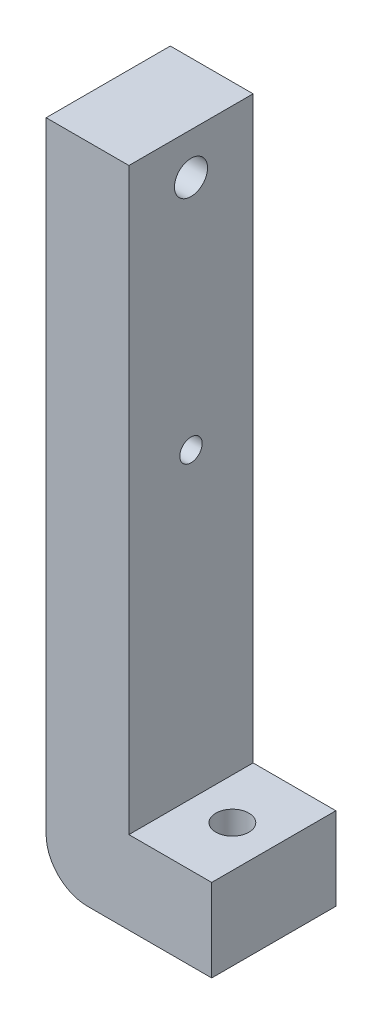
ISO-10303-21;
HEADER;
FILE_DESCRIPTION(('STEP AP214'),'2;1');
FILE_NAME('part.step','',(''),(''),'','','');
FILE_SCHEMA(('AUTOMOTIVE_DESIGN { 1 0 10303 214 1 1 1 1 }'));
ENDSEC;
DATA;
#1=APPLICATION_CONTEXT('core data for automotive mechanical design processes');
#2=APPLICATION_PROTOCOL_DEFINITION('international standard','automotive_design',2000,#1);
#3=PRODUCT_CONTEXT('',#1,'mechanical');
#4=PRODUCT('Part','Part','',(#3));
#5=PRODUCT_RELATED_PRODUCT_CATEGORY('part','',(#4));
#6=PRODUCT_DEFINITION_FORMATION('','',#4);
#7=PRODUCT_DEFINITION_CONTEXT('part definition',#1,'design');
#8=PRODUCT_DEFINITION('design','',#6,#7);
#9=PRODUCT_DEFINITION_SHAPE('','',#8);
#10=(LENGTH_UNIT() NAMED_UNIT(*) SI_UNIT(.MILLI.,.METRE.));
#11=(NAMED_UNIT(*) PLANE_ANGLE_UNIT() SI_UNIT($,.RADIAN.));
#12=(NAMED_UNIT(*) SI_UNIT($,.STERADIAN.) SOLID_ANGLE_UNIT());
#13=UNCERTAINTY_MEASURE_WITH_UNIT(LENGTH_MEASURE(1.E-05),#10,'distance_accuracy_value','');
#14=(GEOMETRIC_REPRESENTATION_CONTEXT(3) GLOBAL_UNCERTAINTY_ASSIGNED_CONTEXT((#13)) GLOBAL_UNIT_ASSIGNED_CONTEXT((#10,
#11,#12)) REPRESENTATION_CONTEXT('',''));
#15=CARTESIAN_POINT('',(0.,0.,0.));
#16=DIRECTION('',(0.,0.,1.));
#17=DIRECTION('',(1.,0.,0.));
#18=AXIS2_PLACEMENT_3D('',#15,#16,#17);
#19=CARTESIAN_POINT('',(-10.,-20.,15.));
#20=DIRECTION('',(1.,0.,0.));
#21=DIRECTION('',(0.,0.,-1.));
#22=AXIS2_PLACEMENT_3D('',#19,#20,#21);
#23=PLANE('',#22);
#24=CARTESIAN_POINT('',(-10.,26.5,7.5));
#25=DIRECTION('',(-1.,0.,0.));
#26=DIRECTION('',(0.,0.,1.));
#27=AXIS2_PLACEMENT_3D('',#24,#25,#26);
#28=CIRCLE('',#27,1.35);
#29=CARTESIAN_POINT('',(-10.,26.5,8.85));
#30=VERTEX_POINT('',#29);
#31=EDGE_CURVE('E176',#30,#30,#28,.T.);
#32=ORIENTED_EDGE('',*,*,#31,.F.);
#33=EDGE_LOOP('',(#32));
#34=FACE_BOUND('',#33,.T.);
#35=CARTESIAN_POINT('',(-10.,55.,7.5));
#36=DIRECTION('',(-1.,0.,0.));
#37=DIRECTION('',(0.,0.,1.));
#38=AXIS2_PLACEMENT_3D('',#35,#36,#37);
#39=CIRCLE('',#38,2.);
#40=CARTESIAN_POINT('',(-10.,55.,9.49999999999999));
#41=VERTEX_POINT('',#40);
#42=EDGE_CURVE('E168',#41,#41,#39,.T.);
#43=ORIENTED_EDGE('',*,*,#42,.F.);
#44=EDGE_LOOP('',(#43));
#45=FACE_BOUND('',#44,.T.);
#46=DIRECTION('',(0.,-1.,0.));
#47=VECTOR('',#46,1.);
#48=CARTESIAN_POINT('',(-10.,-20.,0.));
#49=LINE('',#48,#47);
#50=CARTESIAN_POINT('',(-10.,60.,0.));
#51=VERTEX_POINT('',#50);
#52=CARTESIAN_POINT('',(-10.,-15.,0.));
#53=VERTEX_POINT('',#52);
#54=EDGE_CURVE('E120',#51,#53,#49,.T.);
#55=ORIENTED_EDGE('',*,*,#54,.T.);
#56=DIRECTION('',(0.,0.,-1.));
#57=VECTOR('',#56,1.);
#58=CARTESIAN_POINT('',(-10.,-15.,15.));
#59=LINE('',#58,#57);
#60=CARTESIAN_POINT('',(-10.,-15.,15.));
#61=VERTEX_POINT('',#60);
#62=EDGE_CURVE('E54',#53,#61,#59,.F.);
#63=ORIENTED_EDGE('',*,*,#62,.T.);
#64=DIRECTION('',(0.,-1.,0.));
#65=VECTOR('',#64,1.);
#66=CARTESIAN_POINT('',(-10.,-20.,15.));
#67=LINE('',#66,#65);
#68=CARTESIAN_POINT('',(-10.,60.,15.));
#69=VERTEX_POINT('',#68);
#70=EDGE_CURVE('E114',#69,#61,#67,.T.);
#71=ORIENTED_EDGE('',*,*,#70,.F.);
#72=DIRECTION('',(0.,0.,1.));
#73=VECTOR('',#72,1.);
#74=CARTESIAN_POINT('',(-10.,60.,0.));
#75=LINE('',#74,#73);
#76=EDGE_CURVE('E124',#51,#69,#75,.T.);
#77=ORIENTED_EDGE('',*,*,#76,.F.);
#78=EDGE_LOOP('',(#55,#63,#71,#77));
#79=FACE_BOUND('',#78,.T.);
#80=ADVANCED_FACE('F45',(#34,#45,#79),#23,.F.);
#81=CARTESIAN_POINT('',(-10.,-20.,15.));
#82=DIRECTION('',(0.,1.,0.));
#83=DIRECTION('',(0.,0.,1.));
#84=AXIS2_PLACEMENT_3D('',#81,#82,#83);
#85=PLANE('',#84);
#86=CARTESIAN_POINT('',(5.,-20.,7.5));
#87=DIRECTION('',(0.,-1.,0.));
#88=DIRECTION('',(0.,0.,-1.));
#89=AXIS2_PLACEMENT_3D('',#86,#87,#88);
#90=CIRCLE('',#89,2.);
#91=CARTESIAN_POINT('',(5.,-20.,5.5));
#92=VERTEX_POINT('',#91);
#93=EDGE_CURVE('E133',#92,#92,#90,.T.);
#94=ORIENTED_EDGE('',*,*,#93,.F.);
#95=EDGE_LOOP('',(#94));
#96=FACE_BOUND('',#95,.T.);
#97=DIRECTION('',(1.,0.,0.));
#98=VECTOR('',#97,1.);
#99=CARTESIAN_POINT('',(-10.,-20.,15.));
#100=LINE('',#99,#98);
#101=CARTESIAN_POINT('',(-5.,-20.,15.));
#102=VERTEX_POINT('',#101);
#103=CARTESIAN_POINT('',(10.,-20.,15.));
#104=VERTEX_POINT('',#103);
#105=EDGE_CURVE('E141',#102,#104,#100,.T.);
#106=ORIENTED_EDGE('',*,*,#105,.F.);
#107=DIRECTION('',(0.,0.,-1.));
#108=VECTOR('',#107,1.);
#109=CARTESIAN_POINT('',(-5.,-20.,15.));
#110=LINE('',#109,#108);
#111=CARTESIAN_POINT('',(-5.,-20.,0.));
#112=VERTEX_POINT('',#111);
#113=EDGE_CURVE('E162',#102,#112,#110,.T.);
#114=ORIENTED_EDGE('',*,*,#113,.T.);
#115=DIRECTION('',(1.,0.,0.));
#116=VECTOR('',#115,1.);
#117=CARTESIAN_POINT('',(-10.,-20.,0.));
#118=LINE('',#117,#116);
#119=CARTESIAN_POINT('',(10.,-20.,0.));
#120=VERTEX_POINT('',#119);
#121=EDGE_CURVE('E150',#112,#120,#118,.T.);
#122=ORIENTED_EDGE('',*,*,#121,.T.);
#123=DIRECTION('',(0.,0.,-1.));
#124=VECTOR('',#123,1.);
#125=CARTESIAN_POINT('',(10.,-20.,15.));
#126=LINE('',#125,#124);
#127=EDGE_CURVE('E159',#104,#120,#126,.T.);
#128=ORIENTED_EDGE('',*,*,#127,.F.);
#129=EDGE_LOOP('',(#106,#114,#122,#128));
#130=FACE_BOUND('',#129,.T.);
#131=ADVANCED_FACE('F186',(#96,#130),#85,.F.);
#132=CARTESIAN_POINT('',(10.,-20.,15.));
#133=DIRECTION('',(-1.,0.,0.));
#134=DIRECTION('',(0.,-1.,0.));
#135=AXIS2_PLACEMENT_3D('',#132,#133,#134);
#136=PLANE('',#135);
#137=DIRECTION('',(0.,1.,0.));
#138=VECTOR('',#137,1.);
#139=CARTESIAN_POINT('',(10.,-20.,0.));
#140=LINE('',#139,#138);
#141=CARTESIAN_POINT('',(10.,-10.,0.));
#142=VERTEX_POINT('',#141);
#143=EDGE_CURVE('E152',#120,#142,#140,.T.);
#144=ORIENTED_EDGE('',*,*,#143,.T.);
#145=DIRECTION('',(0.,0.,-1.));
#146=VECTOR('',#145,1.);
#147=CARTESIAN_POINT('',(10.,-10.,15.));
#148=LINE('',#147,#146);
#149=CARTESIAN_POINT('',(10.,-10.,15.));
#150=VERTEX_POINT('',#149);
#151=EDGE_CURVE('E156',#150,#142,#148,.T.);
#152=ORIENTED_EDGE('',*,*,#151,.F.);
#153=DIRECTION('',(0.,1.,0.));
#154=VECTOR('',#153,1.);
#155=CARTESIAN_POINT('',(10.,-20.,15.));
#156=LINE('',#155,#154);
#157=EDGE_CURVE('E143',#104,#150,#156,.T.);
#158=ORIENTED_EDGE('',*,*,#157,.F.);
#159=ORIENTED_EDGE('',*,*,#127,.T.);
#160=EDGE_LOOP('',(#144,#152,#158,#159));
#161=FACE_BOUND('',#160,.T.);
#162=ADVANCED_FACE('F199',(#161),#136,.F.);
#163=CARTESIAN_POINT('',(0.,-10.,15.));
#164=DIRECTION('',(0.,-1.,0.));
#165=DIRECTION('',(0.,0.,-1.));
#166=AXIS2_PLACEMENT_3D('',#163,#164,#165);
#167=PLANE('',#166);
#168=CARTESIAN_POINT('',(5.,-9.99999999999999,7.5));
#169=DIRECTION('',(0.,-1.,0.));
#170=DIRECTION('',(0.,0.,-1.));
#171=AXIS2_PLACEMENT_3D('',#168,#169,#170);
#172=CIRCLE('',#171,2.);
#173=CARTESIAN_POINT('',(5.,-9.99999999999999,5.5));
#174=VERTEX_POINT('',#173);
#175=EDGE_CURVE('E130',#174,#174,#172,.T.);
#176=ORIENTED_EDGE('',*,*,#175,.T.);
#177=EDGE_LOOP('',(#176));
#178=FACE_BOUND('',#177,.T.);
#179=DIRECTION('',(-1.,0.,0.));
#180=VECTOR('',#179,1.);
#181=CARTESIAN_POINT('',(0.,-10.,0.));
#182=LINE('',#181,#180);
#183=CARTESIAN_POINT('',(0.,-10.,0.));
#184=VERTEX_POINT('',#183);
#185=EDGE_CURVE('E115',#142,#184,#182,.T.);
#186=ORIENTED_EDGE('',*,*,#185,.T.);
#187=DIRECTION('',(0.,0.,-1.));
#188=VECTOR('',#187,1.);
#189=CARTESIAN_POINT('',(0.,-10.,15.));
#190=LINE('',#189,#188);
#191=CARTESIAN_POINT('',(0.,-10.,15.));
#192=VERTEX_POINT('',#191);
#193=EDGE_CURVE('E112',#192,#184,#190,.T.);
#194=ORIENTED_EDGE('',*,*,#193,.F.);
#195=DIRECTION('',(-1.,0.,0.));
#196=VECTOR('',#195,1.);
#197=CARTESIAN_POINT('',(0.,-10.,15.));
#198=LINE('',#197,#196);
#199=EDGE_CURVE('E145',#150,#192,#198,.T.);
#200=ORIENTED_EDGE('',*,*,#199,.F.);
#201=ORIENTED_EDGE('',*,*,#151,.T.);
#202=EDGE_LOOP('',(#186,#194,#200,#201));
#203=FACE_BOUND('',#202,.T.);
#204=ADVANCED_FACE('F202',(#178,#203),#167,.F.);
#205=CARTESIAN_POINT('',(0.,20.,15.));
#206=DIRECTION('',(-1.,0.,0.));
#207=DIRECTION('',(0.,-1.,0.));
#208=AXIS2_PLACEMENT_3D('',#205,#206,#207);
#209=PLANE('',#208);
#210=CARTESIAN_POINT('',(0.,26.5,7.5));
#211=DIRECTION('',(-1.,0.,0.));
#212=DIRECTION('',(0.,-1.,0.));
#213=AXIS2_PLACEMENT_3D('',#210,#211,#212);
#214=CIRCLE('',#213,1.35);
#215=CARTESIAN_POINT('',(0.,25.15,7.5));
#216=VERTEX_POINT('',#215);
#217=EDGE_CURVE('E49',#216,#216,#214,.T.);
#218=ORIENTED_EDGE('',*,*,#217,.T.);
#219=EDGE_LOOP('',(#218));
#220=FACE_BOUND('',#219,.T.);
#221=CARTESIAN_POINT('',(0.,55.,7.5));
#222=DIRECTION('',(-1.,0.,0.));
#223=DIRECTION('',(0.,-1.,0.));
#224=AXIS2_PLACEMENT_3D('',#221,#222,#223);
#225=CIRCLE('',#224,2.);
#226=CARTESIAN_POINT('',(0.,53.,7.5));
#227=VERTEX_POINT('',#226);
#228=EDGE_CURVE('E166',#227,#227,#225,.T.);
#229=ORIENTED_EDGE('',*,*,#228,.T.);
#230=EDGE_LOOP('',(#229));
#231=FACE_BOUND('',#230,.T.);
#232=DIRECTION('',(0.,1.,0.));
#233=VECTOR('',#232,1.);
#234=CARTESIAN_POINT('',(0.,20.,0.));
#235=LINE('',#234,#233);
#236=CARTESIAN_POINT('',(0.,60.,0.));
#237=VERTEX_POINT('',#236);
#238=EDGE_CURVE('E105',#184,#237,#235,.T.);
#239=ORIENTED_EDGE('',*,*,#238,.T.);
#240=DIRECTION('',(0.,0.,-1.));
#241=VECTOR('',#240,1.);
#242=CARTESIAN_POINT('',(0.,60.,15.));
#243=LINE('',#242,#241);
#244=CARTESIAN_POINT('',(0.,60.,15.));
#245=VERTEX_POINT('',#244);
#246=EDGE_CURVE('E110',#245,#237,#243,.T.);
#247=ORIENTED_EDGE('',*,*,#246,.F.);
#248=DIRECTION('',(0.,1.,0.));
#249=VECTOR('',#248,1.);
#250=CARTESIAN_POINT('',(0.,20.,15.));
#251=LINE('',#250,#249);
#252=EDGE_CURVE('E147',#192,#245,#251,.T.);
#253=ORIENTED_EDGE('',*,*,#252,.F.);
#254=ORIENTED_EDGE('',*,*,#193,.T.);
#255=EDGE_LOOP('',(#239,#247,#253,#254));
#256=FACE_BOUND('',#255,.T.);
#257=ADVANCED_FACE('F107',(#220,#231,#256),#209,.F.);
#258=CARTESIAN_POINT('',(0.,0.,15.));
#259=DIRECTION('',(0.,0.,-1.));
#260=DIRECTION('',(-1.,0.,0.));
#261=AXIS2_PLACEMENT_3D('',#258,#259,#260);
#262=PLANE('',#261);
#263=ORIENTED_EDGE('',*,*,#70,.T.);
#264=CARTESIAN_POINT('',(-5.,-15.,15.));
#265=DIRECTION('',(0.,0.,-1.));
#266=DIRECTION('',(-1.,0.,0.));
#267=AXIS2_PLACEMENT_3D('',#264,#265,#266);
#268=CIRCLE('',#267,5.);
#269=EDGE_CURVE('E13',#61,#102,#268,.F.);
#270=ORIENTED_EDGE('',*,*,#269,.T.);
#271=ORIENTED_EDGE('',*,*,#105,.T.);
#272=ORIENTED_EDGE('',*,*,#157,.T.);
#273=ORIENTED_EDGE('',*,*,#199,.T.);
#274=ORIENTED_EDGE('',*,*,#252,.T.);
#275=DIRECTION('',(1.,0.,0.));
#276=VECTOR('',#275,1.);
#277=CARTESIAN_POINT('',(-10.,60.,15.));
#278=LINE('',#277,#276);
#279=EDGE_CURVE('E129',#69,#245,#278,.T.);
#280=ORIENTED_EDGE('',*,*,#279,.F.);
#281=EDGE_LOOP('',(#263,#270,#271,#272,#273,#274,#280));
#282=FACE_BOUND('',#281,.T.);
#283=ADVANCED_FACE('F192',(#282),#262,.F.);
#284=CARTESIAN_POINT('',(0.,0.,0.));
#285=DIRECTION('',(0.,0.,-1.));
#286=DIRECTION('',(-1.,0.,0.));
#287=AXIS2_PLACEMENT_3D('',#284,#285,#286);
#288=PLANE('',#287);
#289=ORIENTED_EDGE('',*,*,#121,.F.);
#290=CARTESIAN_POINT('',(-5.,-15.,0.));
#291=DIRECTION('',(0.,0.,-1.));
#292=DIRECTION('',(-1.,0.,0.));
#293=AXIS2_PLACEMENT_3D('',#290,#291,#292);
#294=CIRCLE('',#293,5.);
#295=EDGE_CURVE('E69',#112,#53,#294,.T.);
#296=ORIENTED_EDGE('',*,*,#295,.T.);
#297=ORIENTED_EDGE('',*,*,#54,.F.);
#298=DIRECTION('',(-1.,0.,0.));
#299=VECTOR('',#298,1.);
#300=CARTESIAN_POINT('',(0.,60.,0.));
#301=LINE('',#300,#299);
#302=EDGE_CURVE('E118',#237,#51,#301,.T.);
#303=ORIENTED_EDGE('',*,*,#302,.F.);
#304=ORIENTED_EDGE('',*,*,#238,.F.);
#305=ORIENTED_EDGE('',*,*,#185,.F.);
#306=ORIENTED_EDGE('',*,*,#143,.F.);
#307=EDGE_LOOP('',(#289,#296,#297,#303,#304,#305,#306));
#308=FACE_BOUND('',#307,.T.);
#309=ADVANCED_FACE('F119',(#308),#288,.T.);
#310=CARTESIAN_POINT('',(-5.,-15.,15.));
#311=DIRECTION('',(0.,0.,-1.));
#312=DIRECTION('',(-1.,0.,0.));
#313=AXIS2_PLACEMENT_3D('',#310,#311,#312);
#314=CYLINDRICAL_SURFACE('',#313,5.);
#315=ORIENTED_EDGE('',*,*,#269,.F.);
#316=ORIENTED_EDGE('',*,*,#62,.F.);
#317=ORIENTED_EDGE('',*,*,#295,.F.);
#318=ORIENTED_EDGE('',*,*,#113,.F.);
#319=EDGE_LOOP('',(#315,#316,#317,#318));
#320=FACE_BOUND('',#319,.T.);
#321=ADVANCED_FACE('F47',(#320),#314,.T.);
#322=CARTESIAN_POINT('',(0.,60.,0.));
#323=DIRECTION('',(0.,1.,0.));
#324=DIRECTION('',(0.,0.,1.));
#325=AXIS2_PLACEMENT_3D('',#322,#323,#324);
#326=PLANE('',#325);
#327=ORIENTED_EDGE('',*,*,#246,.T.);
#328=ORIENTED_EDGE('',*,*,#302,.T.);
#329=ORIENTED_EDGE('',*,*,#76,.T.);
#330=ORIENTED_EDGE('',*,*,#279,.T.);
#331=EDGE_LOOP('',(#327,#328,#329,#330));
#332=FACE_BOUND('',#331,.T.);
#333=ADVANCED_FACE('F127',(#332),#326,.T.);
#334=CARTESIAN_POINT('',(5.,60.,7.5));
#335=DIRECTION('',(0.,-1.,0.));
#336=DIRECTION('',(0.,0.,-1.));
#337=AXIS2_PLACEMENT_3D('',#334,#335,#336);
#338=CYLINDRICAL_SURFACE('',#337,2.);
#339=ORIENTED_EDGE('',*,*,#93,.T.);
#340=EDGE_LOOP('',(#339));
#341=FACE_BOUND('',#340,.T.);
#342=ORIENTED_EDGE('',*,*,#175,.F.);
#343=EDGE_LOOP('',(#342));
#344=FACE_BOUND('',#343,.T.);
#345=ADVANCED_FACE('F223',(#341,#344),#338,.F.);
#346=CARTESIAN_POINT('',(10.,55.,7.5));
#347=DIRECTION('',(-1.,0.,0.));
#348=DIRECTION('',(0.,0.,1.));
#349=AXIS2_PLACEMENT_3D('',#346,#347,#348);
#350=CYLINDRICAL_SURFACE('',#349,2.);
#351=ORIENTED_EDGE('',*,*,#42,.T.);
#352=EDGE_LOOP('',(#351));
#353=FACE_BOUND('',#352,.T.);
#354=ORIENTED_EDGE('',*,*,#228,.F.);
#355=EDGE_LOOP('',(#354));
#356=FACE_BOUND('',#355,.T.);
#357=ADVANCED_FACE('F226',(#353,#356),#350,.F.);
#358=CARTESIAN_POINT('',(10.,26.5,7.5));
#359=DIRECTION('',(-1.,0.,0.));
#360=DIRECTION('',(0.,0.,1.));
#361=AXIS2_PLACEMENT_3D('',#358,#359,#360);
#362=CYLINDRICAL_SURFACE('',#361,1.35);
#363=ORIENTED_EDGE('',*,*,#31,.T.);
#364=EDGE_LOOP('',(#363));
#365=FACE_BOUND('',#364,.T.);
#366=ORIENTED_EDGE('',*,*,#217,.F.);
#367=EDGE_LOOP('',(#366));
#368=FACE_BOUND('',#367,.T.);
#369=ADVANCED_FACE('F181',(#365,#368),#362,.F.);
#370=CLOSED_SHELL('',(#80,#131,#162,#204,#257,#283,#309,#321,#333,#345,#357,#369));
#371=MANIFOLD_SOLID_BREP('B2',#370);
#372=ADVANCED_BREP_SHAPE_REPRESENTATION('',(#18,#371),#14);
#373=SHAPE_DEFINITION_REPRESENTATION(#9,#372);
ENDSEC;
END-ISO-10303-21;
